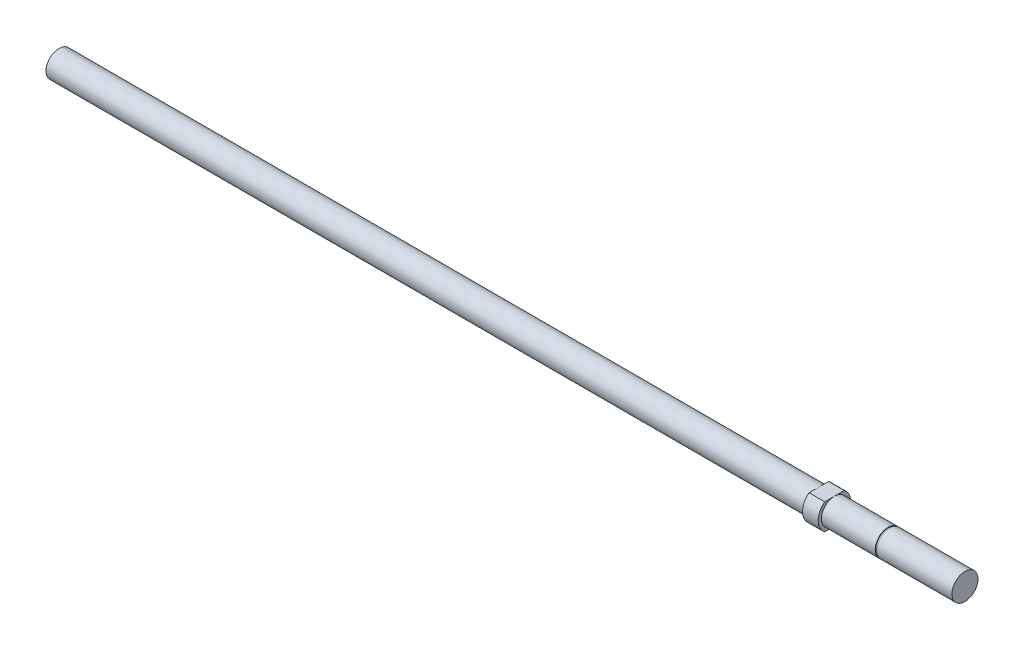
ISO-10303-21;
HEADER;
FILE_DESCRIPTION(('STEP AP214'),'2;1');
FILE_NAME('part.step','',(''),(''),'','','');
FILE_SCHEMA(('AUTOMOTIVE_DESIGN { 1 0 10303 214 1 1 1 1 }'));
ENDSEC;
DATA;
#1=APPLICATION_CONTEXT('core data for automotive mechanical design processes');
#2=APPLICATION_PROTOCOL_DEFINITION('international standard','automotive_design',2000,#1);
#3=PRODUCT_CONTEXT('',#1,'mechanical');
#4=PRODUCT('Part','Part','',(#3));
#5=PRODUCT_RELATED_PRODUCT_CATEGORY('part','',(#4));
#6=PRODUCT_DEFINITION_FORMATION('','',#4);
#7=PRODUCT_DEFINITION_CONTEXT('part definition',#1,'design');
#8=PRODUCT_DEFINITION('design','',#6,#7);
#9=PRODUCT_DEFINITION_SHAPE('','',#8);
#10=(LENGTH_UNIT() NAMED_UNIT(*) SI_UNIT(.MILLI.,.METRE.));
#11=(NAMED_UNIT(*) PLANE_ANGLE_UNIT() SI_UNIT($,.RADIAN.));
#12=(NAMED_UNIT(*) SI_UNIT($,.STERADIAN.) SOLID_ANGLE_UNIT());
#13=UNCERTAINTY_MEASURE_WITH_UNIT(LENGTH_MEASURE(1.E-05),#10,'distance_accuracy_value','');
#14=(GEOMETRIC_REPRESENTATION_CONTEXT(3) GLOBAL_UNCERTAINTY_ASSIGNED_CONTEXT((#13)) GLOBAL_UNIT_ASSIGNED_CONTEXT((#10,
#11,#12)) REPRESENTATION_CONTEXT('',''));
#15=CARTESIAN_POINT('',(0.,0.,0.));
#16=DIRECTION('',(0.,0.,1.));
#17=DIRECTION('',(1.,0.,0.));
#18=AXIS2_PLACEMENT_3D('',#15,#16,#17);
#19=CARTESIAN_POINT('',(-35.56,3.17499999999997,0.));
#20=DIRECTION('',(-1.,0.,0.));
#21=DIRECTION('',(0.,-1.,0.));
#22=AXIS2_PLACEMENT_3D('',#19,#20,#21);
#23=PLANE('',#22);
#24=CARTESIAN_POINT('',(-35.56,0.,0.));
#25=DIRECTION('',(1.,0.,0.));
#26=DIRECTION('',(0.,1.,0.));
#27=AXIS2_PLACEMENT_3D('',#24,#25,#26);
#28=CIRCLE('',#27,3.96875);
#29=CARTESIAN_POINT('',(-35.56,3.17499999999998,2.38125000000002));
#30=VERTEX_POINT('',#29);
#31=CARTESIAN_POINT('',(-35.56,-3.17499999999999,2.38125000000002));
#32=VERTEX_POINT('',#31);
#33=EDGE_CURVE('E121',#30,#32,#28,.T.);
#34=ORIENTED_EDGE('',*,*,#33,.F.);
#35=DIRECTION('',(0.,0.,-1.));
#36=VECTOR('',#35,1.);
#37=CARTESIAN_POINT('',(-35.56,3.17499999999997,0.));
#38=LINE('',#37,#36);
#39=CARTESIAN_POINT('',(-35.56,3.17499999999997,0.));
#40=VERTEX_POINT('',#39);
#41=EDGE_CURVE('E184',#30,#40,#38,.T.);
#42=ORIENTED_EDGE('',*,*,#41,.T.);
#43=CARTESIAN_POINT('',(-35.56,0.,0.));
#44=DIRECTION('',(1.,0.,0.));
#45=DIRECTION('',(0.,1.,0.));
#46=AXIS2_PLACEMENT_3D('',#43,#44,#45);
#47=CIRCLE('',#46,3.17499999999998);
#48=CARTESIAN_POINT('',(-35.56,-3.17499999999999,0.));
#49=VERTEX_POINT('',#48);
#50=EDGE_CURVE('E42',#40,#49,#47,.T.);
#51=ORIENTED_EDGE('',*,*,#50,.T.);
#52=DIRECTION('',(0.,0.,1.));
#53=VECTOR('',#52,1.);
#54=CARTESIAN_POINT('',(-35.56,-3.17499999999999,0.));
#55=LINE('',#54,#53);
#56=EDGE_CURVE('E189',#49,#32,#55,.T.);
#57=ORIENTED_EDGE('',*,*,#56,.T.);
#58=EDGE_LOOP('',(#34,#42,#51,#57));
#59=FACE_BOUND('',#58,.T.);
#60=ADVANCED_FACE('F34',(#59),#23,.T.);
#61=EDGE_CURVE('E122',#49,#40,#47,.T.);
#62=ORIENTED_EDGE('',*,*,#61,.T.);
#63=CARTESIAN_POINT('',(-35.56,3.17499999999998,-2.38125000000002));
#64=VERTEX_POINT('',#63);
#65=EDGE_CURVE('E135',#40,#64,#38,.T.);
#66=ORIENTED_EDGE('',*,*,#65,.T.);
#67=CARTESIAN_POINT('',(-35.56,-3.17499999999999,-2.38125000000002));
#68=VERTEX_POINT('',#67);
#69=EDGE_CURVE('E120',#68,#64,#28,.T.);
#70=ORIENTED_EDGE('',*,*,#69,.F.);
#71=EDGE_CURVE('E103',#68,#49,#55,.T.);
#72=ORIENTED_EDGE('',*,*,#71,.T.);
#73=EDGE_LOOP('',(#62,#66,#70,#72));
#74=FACE_BOUND('',#73,.T.);
#75=ADVANCED_FACE('F133',(#74),#23,.T.);
#76=CARTESIAN_POINT('',(0.,0.,0.));
#77=DIRECTION('',(1.,0.,0.));
#78=DIRECTION('',(0.,1.,0.));
#79=AXIS2_PLACEMENT_3D('',#76,#77,#78);
#80=CYLINDRICAL_SURFACE('',#79,3.96875);
#81=ORIENTED_EDGE('',*,*,#33,.T.);
#82=DIRECTION('',(1.,0.,0.));
#83=VECTOR('',#82,1.);
#84=CARTESIAN_POINT('',(0.,-3.17499999999999,2.38125000000002));
#85=LINE('',#84,#83);
#86=CARTESIAN_POINT('',(-31.75,-3.17499999999999,2.38125000000002));
#87=VERTEX_POINT('',#86);
#88=EDGE_CURVE('E102',#32,#87,#85,.T.);
#89=ORIENTED_EDGE('',*,*,#88,.T.);
#90=CARTESIAN_POINT('',(-31.75,0.,0.));
#91=DIRECTION('',(1.,0.,0.));
#92=DIRECTION('',(0.,1.,0.));
#93=AXIS2_PLACEMENT_3D('',#90,#91,#92);
#94=CIRCLE('',#93,3.96875);
#95=CARTESIAN_POINT('',(-31.75,3.17499999999998,2.38125000000002));
#96=VERTEX_POINT('',#95);
#97=EDGE_CURVE('E101',#96,#87,#94,.T.);
#98=ORIENTED_EDGE('',*,*,#97,.F.);
#99=DIRECTION('',(1.,0.,0.));
#100=VECTOR('',#99,1.);
#101=CARTESIAN_POINT('',(0.,3.17499999999999,2.38125000000002));
#102=LINE('',#101,#100);
#103=EDGE_CURVE('E57',#96,#30,#102,.F.);
#104=ORIENTED_EDGE('',*,*,#103,.T.);
#105=EDGE_LOOP('',(#81,#89,#98,#104));
#106=FACE_BOUND('',#105,.T.);
#107=ADVANCED_FACE('F154',(#106),#80,.T.);
#108=ORIENTED_EDGE('',*,*,#69,.T.);
#109=DIRECTION('',(1.,0.,0.));
#110=VECTOR('',#109,1.);
#111=CARTESIAN_POINT('',(0.,3.17499999999999,-2.38125000000002));
#112=LINE('',#111,#110);
#113=CARTESIAN_POINT('',(-31.75,3.17499999999998,-2.38125000000002));
#114=VERTEX_POINT('',#113);
#115=EDGE_CURVE('E196',#64,#114,#112,.T.);
#116=ORIENTED_EDGE('',*,*,#115,.T.);
#117=CARTESIAN_POINT('',(-31.75,-3.17499999999999,-2.38125000000002));
#118=VERTEX_POINT('',#117);
#119=EDGE_CURVE('E115',#118,#114,#94,.T.);
#120=ORIENTED_EDGE('',*,*,#119,.F.);
#121=DIRECTION('',(1.,0.,0.));
#122=VECTOR('',#121,1.);
#123=CARTESIAN_POINT('',(0.,-3.17499999999999,-2.38125000000002));
#124=LINE('',#123,#122);
#125=EDGE_CURVE('E49',#118,#68,#124,.F.);
#126=ORIENTED_EDGE('',*,*,#125,.T.);
#127=EDGE_LOOP('',(#108,#116,#120,#126));
#128=FACE_BOUND('',#127,.T.);
#129=ADVANCED_FACE('F159',(#128),#80,.T.);
#130=CARTESIAN_POINT('',(-31.75,3.96875,0.));
#131=DIRECTION('',(1.,0.,0.));
#132=DIRECTION('',(0.,1.,0.));
#133=AXIS2_PLACEMENT_3D('',#130,#131,#132);
#134=PLANE('',#133);
#135=ORIENTED_EDGE('',*,*,#119,.T.);
#136=DIRECTION('',(0.,0.,1.));
#137=VECTOR('',#136,1.);
#138=CARTESIAN_POINT('',(-31.75,3.17499999999998,0.));
#139=LINE('',#138,#137);
#140=CARTESIAN_POINT('',(-31.75,3.17499999999998,0.));
#141=VERTEX_POINT('',#140);
#142=EDGE_CURVE('E109',#114,#141,#139,.T.);
#143=ORIENTED_EDGE('',*,*,#142,.T.);
#144=CARTESIAN_POINT('',(-31.75,0.,0.));
#145=DIRECTION('',(1.,0.,0.));
#146=DIRECTION('',(0.,1.,0.));
#147=AXIS2_PLACEMENT_3D('',#144,#145,#146);
#148=CIRCLE('',#147,3.17499999999998);
#149=CARTESIAN_POINT('',(-31.75,-3.17499999999999,0.));
#150=VERTEX_POINT('',#149);
#151=EDGE_CURVE('E106',#150,#141,#148,.T.);
#152=ORIENTED_EDGE('',*,*,#151,.F.);
#153=DIRECTION('',(0.,0.,-1.));
#154=VECTOR('',#153,1.);
#155=CARTESIAN_POINT('',(-31.75,-3.17499999999999,0.));
#156=LINE('',#155,#154);
#157=EDGE_CURVE('E85',#150,#118,#156,.T.);
#158=ORIENTED_EDGE('',*,*,#157,.T.);
#159=EDGE_LOOP('',(#135,#143,#152,#158));
#160=FACE_BOUND('',#159,.T.);
#161=ADVANCED_FACE('F107',(#160),#134,.T.);
#162=EDGE_CURVE('E99',#141,#150,#148,.T.);
#163=ORIENTED_EDGE('',*,*,#162,.F.);
#164=EDGE_CURVE('E187',#141,#96,#139,.T.);
#165=ORIENTED_EDGE('',*,*,#164,.T.);
#166=ORIENTED_EDGE('',*,*,#97,.T.);
#167=EDGE_CURVE('E89',#87,#150,#156,.T.);
#168=ORIENTED_EDGE('',*,*,#167,.T.);
#169=EDGE_LOOP('',(#163,#165,#166,#168));
#170=FACE_BOUND('',#169,.T.);
#171=ADVANCED_FACE('F97',(#170),#134,.T.);
#172=CARTESIAN_POINT('',(0.,3.17499999999999,0.));
#173=DIRECTION('',(1.,0.,0.));
#174=DIRECTION('',(0.,1.,0.));
#175=AXIS2_PLACEMENT_3D('',#172,#173,#174);
#176=PLANE('',#175);
#177=CARTESIAN_POINT('',(0.,0.,0.));
#178=DIRECTION('',(1.,0.,0.));
#179=DIRECTION('',(0.,1.,0.));
#180=AXIS2_PLACEMENT_3D('',#177,#178,#179);
#181=CIRCLE('',#180,3.17499999999999);
#182=CARTESIAN_POINT('',(0.,3.17499999999999,0.));
#183=VERTEX_POINT('',#182);
#184=EDGE_CURVE('E199',#183,#183,#181,.T.);
#185=ORIENTED_EDGE('',*,*,#184,.T.);
#186=EDGE_LOOP('',(#185));
#187=FACE_BOUND('',#186,.T.);
#188=ADVANCED_FACE('F36',(#187),#176,.T.);
#189=CARTESIAN_POINT('',(-220.472,0.,0.));
#190=DIRECTION('',(-1.,0.,0.));
#191=DIRECTION('',(0.,-1.,0.));
#192=AXIS2_PLACEMENT_3D('',#189,#190,#191);
#193=PLANE('',#192);
#194=CARTESIAN_POINT('',(-220.472,0.,0.));
#195=DIRECTION('',(1.,0.,0.));
#196=DIRECTION('',(0.,1.,0.));
#197=AXIS2_PLACEMENT_3D('',#194,#195,#196);
#198=CIRCLE('',#197,3.175);
#199=CARTESIAN_POINT('',(-220.472,3.17499999999997,0.));
#200=VERTEX_POINT('',#199);
#201=EDGE_CURVE('E12',#200,#200,#198,.T.);
#202=ORIENTED_EDGE('',*,*,#201,.F.);
#203=EDGE_LOOP('',(#202));
#204=FACE_BOUND('',#203,.T.);
#205=ADVANCED_FACE('F139',(#204),#193,.T.);
#206=CARTESIAN_POINT('',(0.,0.,0.));
#207=DIRECTION('',(1.,0.,0.));
#208=DIRECTION('',(0.,1.,0.));
#209=AXIS2_PLACEMENT_3D('',#206,#207,#208);
#210=CYLINDRICAL_SURFACE('',#209,3.17499999999999);
#211=ORIENTED_EDGE('',*,*,#201,.T.);
#212=EDGE_LOOP('',(#211));
#213=FACE_BOUND('',#212,.T.);
#214=ORIENTED_EDGE('',*,*,#50,.F.);
#215=ORIENTED_EDGE('',*,*,#61,.F.);
#216=EDGE_LOOP('',(#214,#215));
#217=FACE_BOUND('',#216,.T.);
#218=ADVANCED_FACE('F137',(#213,#217),#210,.T.);
#219=CARTESIAN_POINT('',(0.,0.,0.));
#220=DIRECTION('',(1.,0.,0.));
#221=DIRECTION('',(0.,1.,0.));
#222=AXIS2_PLACEMENT_3D('',#219,#220,#221);
#223=CYLINDRICAL_SURFACE('',#222,3.17499999999998);
#224=ORIENTED_EDGE('',*,*,#151,.T.);
#225=ORIENTED_EDGE('',*,*,#162,.T.);
#226=EDGE_LOOP('',(#224,#225));
#227=FACE_BOUND('',#226,.T.);
#228=CARTESIAN_POINT('',(-18.669,0.,0.));
#229=DIRECTION('',(1.,0.,0.));
#230=DIRECTION('',(0.,1.,0.));
#231=AXIS2_PLACEMENT_3D('',#228,#229,#230);
#232=CIRCLE('',#231,3.17499999999999);
#233=CARTESIAN_POINT('',(-18.669,3.17499999999998,0.));
#234=VERTEX_POINT('',#233);
#235=EDGE_CURVE('E111',#234,#234,#232,.T.);
#236=ORIENTED_EDGE('',*,*,#235,.F.);
#237=EDGE_LOOP('',(#236));
#238=FACE_BOUND('',#237,.T.);
#239=ADVANCED_FACE('F113',(#227,#238),#223,.T.);
#240=CARTESIAN_POINT('',(-18.669,3.17499999999998,0.));
#241=DIRECTION('',(1.,0.,0.));
#242=DIRECTION('',(0.,1.,0.));
#243=AXIS2_PLACEMENT_3D('',#240,#241,#242);
#244=PLANE('',#243);
#245=ORIENTED_EDGE('',*,*,#235,.T.);
#246=EDGE_LOOP('',(#245));
#247=FACE_BOUND('',#246,.T.);
#248=CARTESIAN_POINT('',(-18.669,0.,0.));
#249=DIRECTION('',(1.,0.,0.));
#250=DIRECTION('',(0.,1.,0.));
#251=AXIS2_PLACEMENT_3D('',#248,#249,#250);
#252=CIRCLE('',#251,3.0226);
#253=CARTESIAN_POINT('',(-18.669,3.0226,0.));
#254=VERTEX_POINT('',#253);
#255=EDGE_CURVE('E207',#254,#254,#252,.T.);
#256=ORIENTED_EDGE('',*,*,#255,.F.);
#257=EDGE_LOOP('',(#256));
#258=FACE_BOUND('',#257,.T.);
#259=ADVANCED_FACE('F146',(#247,#258),#244,.T.);
#260=CARTESIAN_POINT('',(0.,0.,0.));
#261=DIRECTION('',(1.,0.,0.));
#262=DIRECTION('',(0.,1.,0.));
#263=AXIS2_PLACEMENT_3D('',#260,#261,#262);
#264=CYLINDRICAL_SURFACE('',#263,3.0226);
#265=ORIENTED_EDGE('',*,*,#255,.T.);
#266=EDGE_LOOP('',(#265));
#267=FACE_BOUND('',#266,.T.);
#268=CARTESIAN_POINT('',(-18.288,0.,0.));
#269=DIRECTION('',(1.,0.,0.));
#270=DIRECTION('',(0.,1.,0.));
#271=AXIS2_PLACEMENT_3D('',#268,#269,#270);
#272=CIRCLE('',#271,3.0226);
#273=CARTESIAN_POINT('',(-18.288,3.0226,0.));
#274=VERTEX_POINT('',#273);
#275=EDGE_CURVE('E205',#274,#274,#272,.T.);
#276=ORIENTED_EDGE('',*,*,#275,.F.);
#277=EDGE_LOOP('',(#276));
#278=FACE_BOUND('',#277,.T.);
#279=ADVANCED_FACE('F165',(#267,#278),#264,.T.);
#280=CARTESIAN_POINT('',(-18.288,3.0226,0.));
#281=DIRECTION('',(-1.,0.,0.));
#282=DIRECTION('',(0.,-1.,0.));
#283=AXIS2_PLACEMENT_3D('',#280,#281,#282);
#284=PLANE('',#283);
#285=ORIENTED_EDGE('',*,*,#275,.T.);
#286=EDGE_LOOP('',(#285));
#287=FACE_BOUND('',#286,.T.);
#288=CARTESIAN_POINT('',(-18.288,0.,0.));
#289=DIRECTION('',(1.,0.,0.));
#290=DIRECTION('',(0.,1.,0.));
#291=AXIS2_PLACEMENT_3D('',#288,#289,#290);
#292=CIRCLE('',#291,3.17499999999999);
#293=CARTESIAN_POINT('',(-18.288,3.17499999999998,0.));
#294=VERTEX_POINT('',#293);
#295=EDGE_CURVE('E202',#294,#294,#292,.T.);
#296=ORIENTED_EDGE('',*,*,#295,.F.);
#297=EDGE_LOOP('',(#296));
#298=FACE_BOUND('',#297,.T.);
#299=ADVANCED_FACE('F169',(#287,#298),#284,.T.);
#300=CARTESIAN_POINT('',(0.,0.,0.));
#301=DIRECTION('',(1.,0.,0.));
#302=DIRECTION('',(0.,1.,0.));
#303=AXIS2_PLACEMENT_3D('',#300,#301,#302);
#304=CYLINDRICAL_SURFACE('',#303,3.17499999999999);
#305=ORIENTED_EDGE('',*,*,#295,.T.);
#306=EDGE_LOOP('',(#305));
#307=FACE_BOUND('',#306,.T.);
#308=ORIENTED_EDGE('',*,*,#184,.F.);
#309=EDGE_LOOP('',(#308));
#310=FACE_BOUND('',#309,.T.);
#311=ADVANCED_FACE('F173',(#307,#310),#304,.T.);
#312=CARTESIAN_POINT('',(-220.472,-3.17500000000001,3.96875000000001));
#313=DIRECTION('',(0.,-1.,0.));
#314=DIRECTION('',(1.,0.,0.));
#315=AXIS2_PLACEMENT_3D('',#312,#313,#314);
#316=PLANE('',#315);
#317=ORIENTED_EDGE('',*,*,#71,.F.);
#318=ORIENTED_EDGE('',*,*,#125,.F.);
#319=ORIENTED_EDGE('',*,*,#157,.F.);
#320=ORIENTED_EDGE('',*,*,#167,.F.);
#321=ORIENTED_EDGE('',*,*,#88,.F.);
#322=ORIENTED_EDGE('',*,*,#56,.F.);
#323=EDGE_LOOP('',(#317,#318,#319,#320,#321,#322));
#324=FACE_BOUND('',#323,.T.);
#325=ADVANCED_FACE('F87',(#324),#316,.T.);
#326=CARTESIAN_POINT('',(-220.472,3.17499999999996,3.96875000000001));
#327=DIRECTION('',(0.,1.,0.));
#328=DIRECTION('',(-1.,0.,0.));
#329=AXIS2_PLACEMENT_3D('',#326,#327,#328);
#330=PLANE('',#329);
#331=ORIENTED_EDGE('',*,*,#41,.F.);
#332=ORIENTED_EDGE('',*,*,#103,.F.);
#333=ORIENTED_EDGE('',*,*,#164,.F.);
#334=ORIENTED_EDGE('',*,*,#142,.F.);
#335=ORIENTED_EDGE('',*,*,#115,.F.);
#336=ORIENTED_EDGE('',*,*,#65,.F.);
#337=EDGE_LOOP('',(#331,#332,#333,#334,#335,#336));
#338=FACE_BOUND('',#337,.T.);
#339=ADVANCED_FACE('F180',(#338),#330,.T.);
#340=CLOSED_SHELL('',(#60,#75,#107,#129,#161,#171,#188,#205,#218,#239,#259,#279,#299,#311,#325,#339));
#341=MANIFOLD_SOLID_BREP('B2',#340);
#342=ADVANCED_BREP_SHAPE_REPRESENTATION('',(#18,#341),#14);
#343=SHAPE_DEFINITION_REPRESENTATION(#9,#342);
ENDSEC;
END-ISO-10303-21;
